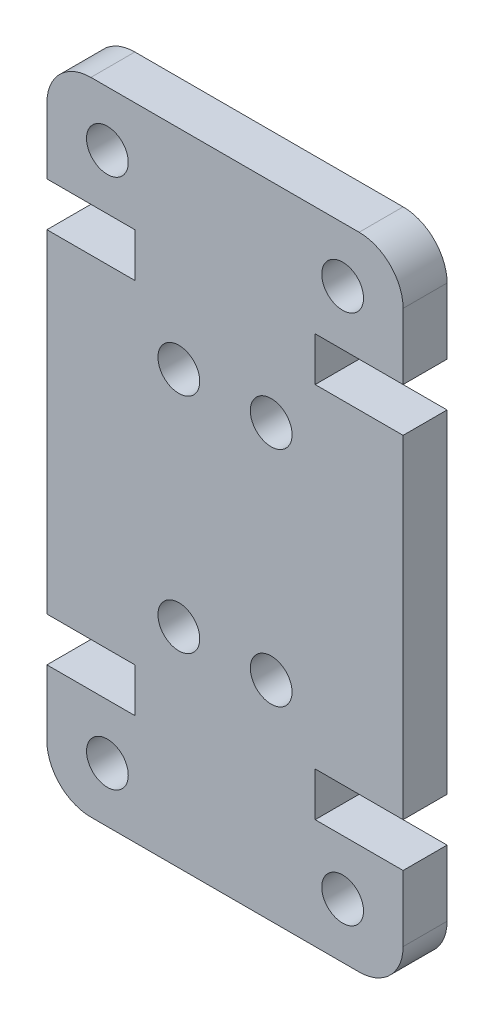
ISO-10303-21;
HEADER;
FILE_DESCRIPTION(('STEP AP214'),'2;1');
FILE_NAME('part.step','',(''),(''),'','','');
FILE_SCHEMA(('AUTOMOTIVE_DESIGN { 1 0 10303 214 1 1 1 1 }'));
ENDSEC;
DATA;
#1=APPLICATION_CONTEXT('core data for automotive mechanical design processes');
#2=APPLICATION_PROTOCOL_DEFINITION('international standard','automotive_design',2000,#1);
#3=PRODUCT_CONTEXT('',#1,'mechanical');
#4=PRODUCT('Part','Part','',(#3));
#5=PRODUCT_RELATED_PRODUCT_CATEGORY('part','',(#4));
#6=PRODUCT_DEFINITION_FORMATION('','',#4);
#7=PRODUCT_DEFINITION_CONTEXT('part definition',#1,'design');
#8=PRODUCT_DEFINITION('design','',#6,#7);
#9=PRODUCT_DEFINITION_SHAPE('','',#8);
#10=(LENGTH_UNIT() NAMED_UNIT(*) SI_UNIT(.MILLI.,.METRE.));
#11=(NAMED_UNIT(*) PLANE_ANGLE_UNIT() SI_UNIT($,.RADIAN.));
#12=(NAMED_UNIT(*) SI_UNIT($,.STERADIAN.) SOLID_ANGLE_UNIT());
#13=UNCERTAINTY_MEASURE_WITH_UNIT(LENGTH_MEASURE(1.E-05),#10,'distance_accuracy_value','');
#14=(GEOMETRIC_REPRESENTATION_CONTEXT(3) GLOBAL_UNCERTAINTY_ASSIGNED_CONTEXT((#13)) GLOBAL_UNIT_ASSIGNED_CONTEXT((#10,
#11,#12)) REPRESENTATION_CONTEXT('',''));
#15=CARTESIAN_POINT('',(0.,0.,0.));
#16=DIRECTION('',(0.,0.,1.));
#17=DIRECTION('',(1.,0.,0.));
#18=AXIS2_PLACEMENT_3D('',#15,#16,#17);
#19=CARTESIAN_POINT('',(2.00000000000002,2.,2.));
#20=DIRECTION('',(0.,0.,1.));
#21=DIRECTION('',(1.,0.,0.));
#22=AXIS2_PLACEMENT_3D('',#19,#20,#21);
#23=PLANE('',#22);
#24=CARTESIAN_POINT('',(10.2,19.6400000000004,2.));
#25=DIRECTION('',(0.,0.,1.));
#26=DIRECTION('',(1.,0.,0.));
#27=AXIS2_PLACEMENT_3D('',#24,#25,#26);
#28=CIRCLE('',#27,0.949999999999999);
#29=CARTESIAN_POINT('',(11.15,19.6400000000004,2.));
#30=VERTEX_POINT('',#29);
#31=EDGE_CURVE('E464',#30,#30,#28,.T.);
#32=ORIENTED_EDGE('',*,*,#31,.F.);
#33=EDGE_LOOP('',(#32));
#34=FACE_BOUND('',#33,.T.);
#35=CARTESIAN_POINT('',(6.,19.6400000000004,2.));
#36=DIRECTION('',(0.,0.,1.));
#37=DIRECTION('',(-1.,0.,0.));
#38=AXIS2_PLACEMENT_3D('',#35,#36,#37);
#39=CIRCLE('',#38,0.949999999999999);
#40=CARTESIAN_POINT('',(5.05,19.6400000000004,2.));
#41=VERTEX_POINT('',#40);
#42=EDGE_CURVE('E476',#41,#41,#39,.T.);
#43=ORIENTED_EDGE('',*,*,#42,.F.);
#44=EDGE_LOOP('',(#43));
#45=FACE_BOUND('',#44,.T.);
#46=CARTESIAN_POINT('',(2.75000000000004,26.6399999999998,2.));
#47=DIRECTION('',(0.,0.,1.));
#48=DIRECTION('',(-1.,0.,0.));
#49=AXIS2_PLACEMENT_3D('',#46,#47,#48);
#50=CIRCLE('',#49,0.95);
#51=CARTESIAN_POINT('',(1.80000000000004,26.6399999999998,2.));
#52=VERTEX_POINT('',#51);
#53=EDGE_CURVE('E488',#52,#52,#50,.T.);
#54=ORIENTED_EDGE('',*,*,#53,.F.);
#55=EDGE_LOOP('',(#54));
#56=FACE_BOUND('',#55,.T.);
#57=CARTESIAN_POINT('',(13.45,2.50000000000017,2.));
#58=DIRECTION('',(0.,0.,1.));
#59=DIRECTION('',(-1.,0.,0.));
#60=AXIS2_PLACEMENT_3D('',#57,#58,#59);
#61=CIRCLE('',#60,0.949999999999999);
#62=CARTESIAN_POINT('',(12.5,2.50000000000017,2.));
#63=VERTEX_POINT('',#62);
#64=EDGE_CURVE('E230',#63,#63,#61,.T.);
#65=ORIENTED_EDGE('',*,*,#64,.F.);
#66=EDGE_LOOP('',(#65));
#67=FACE_BOUND('',#66,.T.);
#68=DIRECTION('',(1.,0.,0.));
#69=VECTOR('',#68,1.);
#70=CARTESIAN_POINT('',(0.,6.99999999999946,2.));
#71=LINE('',#70,#69);
#72=CARTESIAN_POINT('',(0.,6.99999999999946,2.));
#73=VERTEX_POINT('',#72);
#74=CARTESIAN_POINT('',(4.00000000000002,6.99999999999946,2.));
#75=VERTEX_POINT('',#74);
#76=EDGE_CURVE('E273',#73,#75,#71,.T.);
#77=ORIENTED_EDGE('',*,*,#76,.T.);
#78=DIRECTION('',(0.,-1.,0.));
#79=VECTOR('',#78,1.);
#80=CARTESIAN_POINT('',(4.00000000000002,6.99999999999946,2.));
#81=LINE('',#80,#79);
#82=CARTESIAN_POINT('',(4.,4.99999999999945,2.));
#83=VERTEX_POINT('',#82);
#84=EDGE_CURVE('E141',#75,#83,#81,.T.);
#85=ORIENTED_EDGE('',*,*,#84,.T.);
#86=DIRECTION('',(-1.,0.,0.));
#87=VECTOR('',#86,1.);
#88=CARTESIAN_POINT('',(4.,4.99999999999945,2.));
#89=LINE('',#88,#87);
#90=CARTESIAN_POINT('',(0.,4.99999999999945,2.));
#91=VERTEX_POINT('',#90);
#92=EDGE_CURVE('E336',#83,#91,#89,.T.);
#93=ORIENTED_EDGE('',*,*,#92,.T.);
#94=DIRECTION('',(0.,-1.,0.));
#95=VECTOR('',#94,1.);
#96=CARTESIAN_POINT('',(0.,2.,2.));
#97=LINE('',#96,#95);
#98=CARTESIAN_POINT('',(0.,2.,2.));
#99=VERTEX_POINT('',#98);
#100=EDGE_CURVE('E355',#91,#99,#97,.T.);
#101=ORIENTED_EDGE('',*,*,#100,.T.);
#102=CARTESIAN_POINT('',(2.00000000000002,2.,2.));
#103=DIRECTION('',(0.,0.,1.));
#104=DIRECTION('',(1.,0.,0.));
#105=AXIS2_PLACEMENT_3D('',#102,#103,#104);
#106=CIRCLE('',#105,2.00000000000001);
#107=CARTESIAN_POINT('',(2.00000000000002,0.,2.));
#108=VERTEX_POINT('',#107);
#109=EDGE_CURVE('E352',#99,#108,#106,.T.);
#110=ORIENTED_EDGE('',*,*,#109,.T.);
#111=DIRECTION('',(1.,0.,0.));
#112=VECTOR('',#111,1.);
#113=CARTESIAN_POINT('',(2.00000000000002,0.,2.));
#114=LINE('',#113,#112);
#115=CARTESIAN_POINT('',(14.2,0.,2.));
#116=VERTEX_POINT('',#115);
#117=EDGE_CURVE('E354',#108,#116,#114,.T.);
#118=ORIENTED_EDGE('',*,*,#117,.T.);
#119=CARTESIAN_POINT('',(14.2,2.,2.));
#120=DIRECTION('',(0.,0.,1.));
#121=DIRECTION('',(-1.,0.,0.));
#122=AXIS2_PLACEMENT_3D('',#119,#120,#121);
#123=CIRCLE('',#122,2.);
#124=CARTESIAN_POINT('',(16.2,2.,2.));
#125=VERTEX_POINT('',#124);
#126=EDGE_CURVE('E357',#116,#125,#123,.T.);
#127=ORIENTED_EDGE('',*,*,#126,.T.);
#128=DIRECTION('',(0.,1.,0.));
#129=VECTOR('',#128,1.);
#130=CARTESIAN_POINT('',(16.2,2.,2.));
#131=LINE('',#130,#129);
#132=CARTESIAN_POINT('',(16.2,4.99999999999945,2.));
#133=VERTEX_POINT('',#132);
#134=EDGE_CURVE('E363',#125,#133,#131,.T.);
#135=ORIENTED_EDGE('',*,*,#134,.T.);
#136=DIRECTION('',(-1.,0.,0.));
#137=VECTOR('',#136,1.);
#138=CARTESIAN_POINT('',(12.2,4.99999999999945,2.));
#139=LINE('',#138,#137);
#140=CARTESIAN_POINT('',(12.2,4.99999999999945,2.));
#141=VERTEX_POINT('',#140);
#142=EDGE_CURVE('E365',#133,#141,#139,.T.);
#143=ORIENTED_EDGE('',*,*,#142,.T.);
#144=DIRECTION('',(0.,1.,0.));
#145=VECTOR('',#144,1.);
#146=CARTESIAN_POINT('',(12.2,6.99999999999945,2.));
#147=LINE('',#146,#145);
#148=CARTESIAN_POINT('',(12.2,6.99999999999945,2.));
#149=VERTEX_POINT('',#148);
#150=EDGE_CURVE('E367',#141,#149,#147,.T.);
#151=ORIENTED_EDGE('',*,*,#150,.T.);
#152=DIRECTION('',(1.,0.,0.));
#153=VECTOR('',#152,1.);
#154=CARTESIAN_POINT('',(16.2,6.99999999999945,2.));
#155=LINE('',#154,#153);
#156=CARTESIAN_POINT('',(16.2,6.99999999999945,2.));
#157=VERTEX_POINT('',#156);
#158=EDGE_CURVE('E369',#149,#157,#155,.T.);
#159=ORIENTED_EDGE('',*,*,#158,.T.);
#160=DIRECTION('',(0.,1.,0.));
#161=VECTOR('',#160,1.);
#162=CARTESIAN_POINT('',(16.2,22.1400000000005,2.));
#163=LINE('',#162,#161);
#164=CARTESIAN_POINT('',(16.2,22.1400000000005,2.));
#165=VERTEX_POINT('',#164);
#166=EDGE_CURVE('E371',#157,#165,#163,.T.);
#167=ORIENTED_EDGE('',*,*,#166,.T.);
#168=DIRECTION('',(-1.,0.,0.));
#169=VECTOR('',#168,1.);
#170=CARTESIAN_POINT('',(16.2,22.1400000000005,2.));
#171=LINE('',#170,#169);
#172=CARTESIAN_POINT('',(12.2,22.1400000000005,2.));
#173=VERTEX_POINT('',#172);
#174=EDGE_CURVE('E373',#165,#173,#171,.T.);
#175=ORIENTED_EDGE('',*,*,#174,.T.);
#176=DIRECTION('',(0.,1.,0.));
#177=VECTOR('',#176,1.);
#178=CARTESIAN_POINT('',(12.2,22.1400000000005,2.));
#179=LINE('',#178,#177);
#180=CARTESIAN_POINT('',(12.2,24.1400000000006,2.));
#181=VERTEX_POINT('',#180);
#182=EDGE_CURVE('E375',#173,#181,#179,.T.);
#183=ORIENTED_EDGE('',*,*,#182,.T.);
#184=DIRECTION('',(1.,0.,0.));
#185=VECTOR('',#184,1.);
#186=CARTESIAN_POINT('',(12.2,24.1400000000006,2.));
#187=LINE('',#186,#185);
#188=CARTESIAN_POINT('',(16.2,24.1400000000006,2.));
#189=VERTEX_POINT('',#188);
#190=EDGE_CURVE('E377',#181,#189,#187,.T.);
#191=ORIENTED_EDGE('',*,*,#190,.T.);
#192=DIRECTION('',(0.,1.,0.));
#193=VECTOR('',#192,1.);
#194=CARTESIAN_POINT('',(16.2,27.14,2.));
#195=LINE('',#194,#193);
#196=CARTESIAN_POINT('',(16.2,27.14,2.));
#197=VERTEX_POINT('',#196);
#198=EDGE_CURVE('E379',#189,#197,#195,.T.);
#199=ORIENTED_EDGE('',*,*,#198,.T.);
#200=CARTESIAN_POINT('',(14.2,27.14,2.));
#201=DIRECTION('',(0.,0.,1.));
#202=DIRECTION('',(1.,0.,0.));
#203=AXIS2_PLACEMENT_3D('',#200,#201,#202);
#204=CIRCLE('',#203,2.);
#205=CARTESIAN_POINT('',(14.2,29.14,2.));
#206=VERTEX_POINT('',#205);
#207=EDGE_CURVE('E381',#197,#206,#204,.T.);
#208=ORIENTED_EDGE('',*,*,#207,.T.);
#209=DIRECTION('',(-1.,0.,0.));
#210=VECTOR('',#209,1.);
#211=CARTESIAN_POINT('',(1.99999999999999,29.14,2.));
#212=LINE('',#211,#210);
#213=CARTESIAN_POINT('',(1.99999999999999,29.14,2.));
#214=VERTEX_POINT('',#213);
#215=EDGE_CURVE('E383',#206,#214,#212,.T.);
#216=ORIENTED_EDGE('',*,*,#215,.T.);
#217=CARTESIAN_POINT('',(2.,27.14,2.));
#218=DIRECTION('',(0.,0.,1.));
#219=DIRECTION('',(-1.,0.,0.));
#220=AXIS2_PLACEMENT_3D('',#217,#218,#219);
#221=CIRCLE('',#220,2.);
#222=CARTESIAN_POINT('',(0.,27.14,2.));
#223=VERTEX_POINT('',#222);
#224=EDGE_CURVE('E385',#214,#223,#221,.T.);
#225=ORIENTED_EDGE('',*,*,#224,.T.);
#226=DIRECTION('',(0.,-1.,0.));
#227=VECTOR('',#226,1.);
#228=CARTESIAN_POINT('',(0.,27.14,2.));
#229=LINE('',#228,#227);
#230=CARTESIAN_POINT('',(0.,24.1400000000005,2.));
#231=VERTEX_POINT('',#230);
#232=EDGE_CURVE('E387',#223,#231,#229,.T.);
#233=ORIENTED_EDGE('',*,*,#232,.T.);
#234=DIRECTION('',(1.,0.,0.));
#235=VECTOR('',#234,1.);
#236=CARTESIAN_POINT('',(3.99999999999999,24.1400000000006,2.));
#237=LINE('',#236,#235);
#238=CARTESIAN_POINT('',(3.99999999999999,24.1400000000006,2.));
#239=VERTEX_POINT('',#238);
#240=EDGE_CURVE('E208',#231,#239,#237,.T.);
#241=ORIENTED_EDGE('',*,*,#240,.T.);
#242=DIRECTION('',(0.,-1.,0.));
#243=VECTOR('',#242,1.);
#244=CARTESIAN_POINT('',(4.,22.1400000000005,2.));
#245=LINE('',#244,#243);
#246=CARTESIAN_POINT('',(4.,22.1400000000005,2.));
#247=VERTEX_POINT('',#246);
#248=EDGE_CURVE('E202',#239,#247,#245,.T.);
#249=ORIENTED_EDGE('',*,*,#248,.T.);
#250=DIRECTION('',(-1.,0.,0.));
#251=VECTOR('',#250,1.);
#252=CARTESIAN_POINT('',(0.,22.1400000000005,2.));
#253=LINE('',#252,#251);
#254=CARTESIAN_POINT('',(0.,22.1400000000005,2.));
#255=VERTEX_POINT('',#254);
#256=EDGE_CURVE('E206',#247,#255,#253,.T.);
#257=ORIENTED_EDGE('',*,*,#256,.T.);
#258=DIRECTION('',(0.,-1.,0.));
#259=VECTOR('',#258,1.);
#260=CARTESIAN_POINT('',(0.,22.1400000000005,2.));
#261=LINE('',#260,#259);
#262=EDGE_CURVE('E50',#255,#73,#261,.T.);
#263=ORIENTED_EDGE('',*,*,#262,.T.);
#264=EDGE_LOOP('',(#77,#85,#93,#101,#110,#118,#127,#135,#143,#151,#159,#167,#175,#183,#191,#199,
#208,#216,#225,#233,#241,#249,#257,#263));
#265=FACE_BOUND('',#264,.T.);
#266=CARTESIAN_POINT('',(10.2,9.49999999999962,2.));
#267=DIRECTION('',(0.,0.,1.));
#268=DIRECTION('',(-1.,0.,0.));
#269=AXIS2_PLACEMENT_3D('',#266,#267,#268);
#270=CIRCLE('',#269,0.949999999999999);
#271=CARTESIAN_POINT('',(9.24999999999999,9.49999999999962,2.));
#272=VERTEX_POINT('',#271);
#273=EDGE_CURVE('E494',#272,#272,#270,.T.);
#274=ORIENTED_EDGE('',*,*,#273,.F.);
#275=EDGE_LOOP('',(#274));
#276=FACE_BOUND('',#275,.T.);
#277=CARTESIAN_POINT('',(6.00000000000001,9.49999999999962,2.));
#278=DIRECTION('',(0.,0.,1.));
#279=DIRECTION('',(1.,0.,0.));
#280=AXIS2_PLACEMENT_3D('',#277,#278,#279);
#281=CIRCLE('',#280,0.95);
#282=CARTESIAN_POINT('',(6.95,9.49999999999962,2.));
#283=VERTEX_POINT('',#282);
#284=EDGE_CURVE('E482',#283,#283,#281,.T.);
#285=ORIENTED_EDGE('',*,*,#284,.F.);
#286=EDGE_LOOP('',(#285));
#287=FACE_BOUND('',#286,.T.);
#288=CARTESIAN_POINT('',(2.75000000000004,2.50000000000017,2.));
#289=DIRECTION('',(0.,0.,1.));
#290=DIRECTION('',(1.,0.,0.));
#291=AXIS2_PLACEMENT_3D('',#288,#289,#290);
#292=CIRCLE('',#291,0.95);
#293=CARTESIAN_POINT('',(3.70000000000004,2.50000000000017,2.));
#294=VERTEX_POINT('',#293);
#295=EDGE_CURVE('E470',#294,#294,#292,.T.);
#296=ORIENTED_EDGE('',*,*,#295,.F.);
#297=EDGE_LOOP('',(#296));
#298=FACE_BOUND('',#297,.T.);
#299=CARTESIAN_POINT('',(13.45,26.6399999999998,2.));
#300=DIRECTION('',(0.,0.,1.));
#301=DIRECTION('',(1.,0.,0.));
#302=AXIS2_PLACEMENT_3D('',#299,#300,#301);
#303=CIRCLE('',#302,0.949999999999999);
#304=CARTESIAN_POINT('',(14.4,26.6399999999998,2.));
#305=VERTEX_POINT('',#304);
#306=EDGE_CURVE('E455',#305,#305,#303,.T.);
#307=ORIENTED_EDGE('',*,*,#306,.F.);
#308=EDGE_LOOP('',(#307));
#309=FACE_BOUND('',#308,.T.);
#310=ADVANCED_FACE('F33',(#34,#45,#56,#67,#265,#276,#287,#298,#309),#23,.T.);
#311=CARTESIAN_POINT('',(2.00000000000002,2.,0.));
#312=DIRECTION('',(0.,0.,1.));
#313=DIRECTION('',(1.,0.,0.));
#314=AXIS2_PLACEMENT_3D('',#311,#312,#313);
#315=PLANE('',#314);
#316=CARTESIAN_POINT('',(10.2,19.6400000000004,0.));
#317=DIRECTION('',(0.,0.,1.));
#318=DIRECTION('',(1.,0.,0.));
#319=AXIS2_PLACEMENT_3D('',#316,#317,#318);
#320=CIRCLE('',#319,0.949999999999999);
#321=CARTESIAN_POINT('',(11.15,19.6400000000004,0.));
#322=VERTEX_POINT('',#321);
#323=EDGE_CURVE('E461',#322,#322,#320,.T.);
#324=ORIENTED_EDGE('',*,*,#323,.T.);
#325=EDGE_LOOP('',(#324));
#326=FACE_BOUND('',#325,.T.);
#327=CARTESIAN_POINT('',(6.,19.6400000000004,0.));
#328=DIRECTION('',(0.,0.,1.));
#329=DIRECTION('',(-1.,0.,0.));
#330=AXIS2_PLACEMENT_3D('',#327,#328,#329);
#331=CIRCLE('',#330,0.949999999999999);
#332=CARTESIAN_POINT('',(5.05,19.6400000000004,0.));
#333=VERTEX_POINT('',#332);
#334=EDGE_CURVE('E473',#333,#333,#331,.T.);
#335=ORIENTED_EDGE('',*,*,#334,.T.);
#336=EDGE_LOOP('',(#335));
#337=FACE_BOUND('',#336,.T.);
#338=CARTESIAN_POINT('',(2.75000000000004,26.6399999999998,0.));
#339=DIRECTION('',(0.,0.,1.));
#340=DIRECTION('',(-1.,0.,0.));
#341=AXIS2_PLACEMENT_3D('',#338,#339,#340);
#342=CIRCLE('',#341,0.95);
#343=CARTESIAN_POINT('',(1.80000000000004,26.6399999999998,0.));
#344=VERTEX_POINT('',#343);
#345=EDGE_CURVE('E485',#344,#344,#342,.T.);
#346=ORIENTED_EDGE('',*,*,#345,.T.);
#347=EDGE_LOOP('',(#346));
#348=FACE_BOUND('',#347,.T.);
#349=CARTESIAN_POINT('',(13.45,2.50000000000017,0.));
#350=DIRECTION('',(0.,0.,1.));
#351=DIRECTION('',(-1.,0.,0.));
#352=AXIS2_PLACEMENT_3D('',#349,#350,#351);
#353=CIRCLE('',#352,0.949999999999999);
#354=CARTESIAN_POINT('',(12.5,2.50000000000017,0.));
#355=VERTEX_POINT('',#354);
#356=EDGE_CURVE('E497',#355,#355,#353,.T.);
#357=ORIENTED_EDGE('',*,*,#356,.T.);
#358=EDGE_LOOP('',(#357));
#359=FACE_BOUND('',#358,.T.);
#360=DIRECTION('',(1.,0.,0.));
#361=VECTOR('',#360,1.);
#362=CARTESIAN_POINT('',(0.,6.99999999999946,0.));
#363=LINE('',#362,#361);
#364=CARTESIAN_POINT('',(0.,6.99999999999946,0.));
#365=VERTEX_POINT('',#364);
#366=CARTESIAN_POINT('',(4.00000000000002,6.99999999999946,0.));
#367=VERTEX_POINT('',#366);
#368=EDGE_CURVE('E226',#365,#367,#363,.T.);
#369=ORIENTED_EDGE('',*,*,#368,.F.);
#370=DIRECTION('',(0.,-1.,0.));
#371=VECTOR('',#370,1.);
#372=CARTESIAN_POINT('',(0.,22.1400000000005,0.));
#373=LINE('',#372,#371);
#374=CARTESIAN_POINT('',(0.,22.1400000000005,0.));
#375=VERTEX_POINT('',#374);
#376=EDGE_CURVE('E133',#375,#365,#373,.T.);
#377=ORIENTED_EDGE('',*,*,#376,.F.);
#378=DIRECTION('',(-1.,0.,0.));
#379=VECTOR('',#378,1.);
#380=CARTESIAN_POINT('',(0.,22.1400000000005,0.));
#381=LINE('',#380,#379);
#382=CARTESIAN_POINT('',(4.,22.1400000000005,0.));
#383=VERTEX_POINT('',#382);
#384=EDGE_CURVE('E127',#383,#375,#381,.T.);
#385=ORIENTED_EDGE('',*,*,#384,.F.);
#386=DIRECTION('',(0.,-1.,0.));
#387=VECTOR('',#386,1.);
#388=CARTESIAN_POINT('',(4.,22.1400000000005,0.));
#389=LINE('',#388,#387);
#390=CARTESIAN_POINT('',(3.99999999999999,24.1400000000006,0.));
#391=VERTEX_POINT('',#390);
#392=EDGE_CURVE('E216',#391,#383,#389,.T.);
#393=ORIENTED_EDGE('',*,*,#392,.F.);
#394=DIRECTION('',(1.,0.,0.));
#395=VECTOR('',#394,1.);
#396=CARTESIAN_POINT('',(3.99999999999999,24.1400000000006,0.));
#397=LINE('',#396,#395);
#398=CARTESIAN_POINT('',(0.,24.1400000000005,0.));
#399=VERTEX_POINT('',#398);
#400=EDGE_CURVE('E268',#399,#391,#397,.T.);
#401=ORIENTED_EDGE('',*,*,#400,.F.);
#402=DIRECTION('',(0.,-1.,0.));
#403=VECTOR('',#402,1.);
#404=CARTESIAN_POINT('',(0.,27.14,0.));
#405=LINE('',#404,#403);
#406=CARTESIAN_POINT('',(0.,27.14,0.));
#407=VERTEX_POINT('',#406);
#408=EDGE_CURVE('E266',#407,#399,#405,.T.);
#409=ORIENTED_EDGE('',*,*,#408,.F.);
#410=CARTESIAN_POINT('',(2.,27.14,0.));
#411=DIRECTION('',(0.,0.,1.));
#412=DIRECTION('',(-1.,0.,0.));
#413=AXIS2_PLACEMENT_3D('',#410,#411,#412);
#414=CIRCLE('',#413,2.);
#415=CARTESIAN_POINT('',(1.99999999999999,29.14,0.));
#416=VERTEX_POINT('',#415);
#417=EDGE_CURVE('E264',#416,#407,#414,.T.);
#418=ORIENTED_EDGE('',*,*,#417,.F.);
#419=DIRECTION('',(-1.,0.,0.));
#420=VECTOR('',#419,1.);
#421=CARTESIAN_POINT('',(1.99999999999999,29.14,0.));
#422=LINE('',#421,#420);
#423=CARTESIAN_POINT('',(14.2,29.14,0.));
#424=VERTEX_POINT('',#423);
#425=EDGE_CURVE('E262',#424,#416,#422,.T.);
#426=ORIENTED_EDGE('',*,*,#425,.F.);
#427=CARTESIAN_POINT('',(14.2,27.14,0.));
#428=DIRECTION('',(0.,0.,1.));
#429=DIRECTION('',(1.,0.,0.));
#430=AXIS2_PLACEMENT_3D('',#427,#428,#429);
#431=CIRCLE('',#430,2.);
#432=CARTESIAN_POINT('',(16.2,27.14,0.));
#433=VERTEX_POINT('',#432);
#434=EDGE_CURVE('E260',#433,#424,#431,.T.);
#435=ORIENTED_EDGE('',*,*,#434,.F.);
#436=DIRECTION('',(0.,1.,0.));
#437=VECTOR('',#436,1.);
#438=CARTESIAN_POINT('',(16.2,27.14,0.));
#439=LINE('',#438,#437);
#440=CARTESIAN_POINT('',(16.2,24.1400000000006,0.));
#441=VERTEX_POINT('',#440);
#442=EDGE_CURVE('E258',#441,#433,#439,.T.);
#443=ORIENTED_EDGE('',*,*,#442,.F.);
#444=DIRECTION('',(1.,0.,0.));
#445=VECTOR('',#444,1.);
#446=CARTESIAN_POINT('',(12.2,24.1400000000006,0.));
#447=LINE('',#446,#445);
#448=CARTESIAN_POINT('',(12.2,24.1400000000006,0.));
#449=VERTEX_POINT('',#448);
#450=EDGE_CURVE('E256',#449,#441,#447,.T.);
#451=ORIENTED_EDGE('',*,*,#450,.F.);
#452=DIRECTION('',(0.,1.,0.));
#453=VECTOR('',#452,1.);
#454=CARTESIAN_POINT('',(12.2,22.1400000000005,0.));
#455=LINE('',#454,#453);
#456=CARTESIAN_POINT('',(12.2,22.1400000000005,0.));
#457=VERTEX_POINT('',#456);
#458=EDGE_CURVE('E254',#457,#449,#455,.T.);
#459=ORIENTED_EDGE('',*,*,#458,.F.);
#460=DIRECTION('',(-1.,0.,0.));
#461=VECTOR('',#460,1.);
#462=CARTESIAN_POINT('',(16.2,22.1400000000005,0.));
#463=LINE('',#462,#461);
#464=CARTESIAN_POINT('',(16.2,22.1400000000005,0.));
#465=VERTEX_POINT('',#464);
#466=EDGE_CURVE('E252',#465,#457,#463,.T.);
#467=ORIENTED_EDGE('',*,*,#466,.F.);
#468=DIRECTION('',(0.,1.,0.));
#469=VECTOR('',#468,1.);
#470=CARTESIAN_POINT('',(16.2,22.1400000000005,0.));
#471=LINE('',#470,#469);
#472=CARTESIAN_POINT('',(16.2,6.99999999999945,0.));
#473=VERTEX_POINT('',#472);
#474=EDGE_CURVE('E250',#473,#465,#471,.T.);
#475=ORIENTED_EDGE('',*,*,#474,.F.);
#476=DIRECTION('',(1.,0.,0.));
#477=VECTOR('',#476,1.);
#478=CARTESIAN_POINT('',(16.2,6.99999999999945,0.));
#479=LINE('',#478,#477);
#480=CARTESIAN_POINT('',(12.2,6.99999999999945,0.));
#481=VERTEX_POINT('',#480);
#482=EDGE_CURVE('E248',#481,#473,#479,.T.);
#483=ORIENTED_EDGE('',*,*,#482,.F.);
#484=DIRECTION('',(0.,1.,0.));
#485=VECTOR('',#484,1.);
#486=CARTESIAN_POINT('',(12.2,6.99999999999945,0.));
#487=LINE('',#486,#485);
#488=CARTESIAN_POINT('',(12.2,4.99999999999945,0.));
#489=VERTEX_POINT('',#488);
#490=EDGE_CURVE('E246',#489,#481,#487,.T.);
#491=ORIENTED_EDGE('',*,*,#490,.F.);
#492=DIRECTION('',(-1.,0.,0.));
#493=VECTOR('',#492,1.);
#494=CARTESIAN_POINT('',(12.2,4.99999999999945,0.));
#495=LINE('',#494,#493);
#496=CARTESIAN_POINT('',(16.2,4.99999999999945,0.));
#497=VERTEX_POINT('',#496);
#498=EDGE_CURVE('E244',#497,#489,#495,.T.);
#499=ORIENTED_EDGE('',*,*,#498,.F.);
#500=DIRECTION('',(0.,1.,0.));
#501=VECTOR('',#500,1.);
#502=CARTESIAN_POINT('',(16.2,2.,0.));
#503=LINE('',#502,#501);
#504=CARTESIAN_POINT('',(16.2,2.,0.));
#505=VERTEX_POINT('',#504);
#506=EDGE_CURVE('E242',#505,#497,#503,.T.);
#507=ORIENTED_EDGE('',*,*,#506,.F.);
#508=CARTESIAN_POINT('',(14.2,2.,0.));
#509=DIRECTION('',(0.,0.,1.));
#510=DIRECTION('',(-1.,0.,0.));
#511=AXIS2_PLACEMENT_3D('',#508,#509,#510);
#512=CIRCLE('',#511,2.);
#513=CARTESIAN_POINT('',(14.2,0.,0.));
#514=VERTEX_POINT('',#513);
#515=EDGE_CURVE('E240',#514,#505,#512,.T.);
#516=ORIENTED_EDGE('',*,*,#515,.F.);
#517=DIRECTION('',(1.,0.,0.));
#518=VECTOR('',#517,1.);
#519=CARTESIAN_POINT('',(2.00000000000002,0.,0.));
#520=LINE('',#519,#518);
#521=CARTESIAN_POINT('',(2.00000000000002,0.,0.));
#522=VERTEX_POINT('',#521);
#523=EDGE_CURVE('E238',#522,#514,#520,.T.);
#524=ORIENTED_EDGE('',*,*,#523,.F.);
#525=CARTESIAN_POINT('',(2.00000000000002,2.,0.));
#526=DIRECTION('',(0.,0.,1.));
#527=DIRECTION('',(1.,0.,0.));
#528=AXIS2_PLACEMENT_3D('',#525,#526,#527);
#529=CIRCLE('',#528,2.00000000000001);
#530=CARTESIAN_POINT('',(0.,2.,0.));
#531=VERTEX_POINT('',#530);
#532=EDGE_CURVE('E236',#531,#522,#529,.T.);
#533=ORIENTED_EDGE('',*,*,#532,.F.);
#534=DIRECTION('',(0.,-1.,0.));
#535=VECTOR('',#534,1.);
#536=CARTESIAN_POINT('',(0.,2.,0.));
#537=LINE('',#536,#535);
#538=CARTESIAN_POINT('',(0.,4.99999999999945,0.));
#539=VERTEX_POINT('',#538);
#540=EDGE_CURVE('E234',#539,#531,#537,.T.);
#541=ORIENTED_EDGE('',*,*,#540,.F.);
#542=DIRECTION('',(-1.,0.,0.));
#543=VECTOR('',#542,1.);
#544=CARTESIAN_POINT('',(4.,4.99999999999945,0.));
#545=LINE('',#544,#543);
#546=CARTESIAN_POINT('',(4.,4.99999999999945,0.));
#547=VERTEX_POINT('',#546);
#548=EDGE_CURVE('E232',#547,#539,#545,.T.);
#549=ORIENTED_EDGE('',*,*,#548,.F.);
#550=DIRECTION('',(0.,-1.,0.));
#551=VECTOR('',#550,1.);
#552=CARTESIAN_POINT('',(4.00000000000002,6.99999999999946,0.));
#553=LINE('',#552,#551);
#554=EDGE_CURVE('E229',#367,#547,#553,.T.);
#555=ORIENTED_EDGE('',*,*,#554,.F.);
#556=EDGE_LOOP('',(#369,#377,#385,#393,#401,#409,#418,#426,#435,#443,#451,#459,#467,#475,#483,
#491,#499,#507,#516,#524,#533,#541,#549,#555));
#557=FACE_BOUND('',#556,.T.);
#558=CARTESIAN_POINT('',(10.2,9.49999999999962,0.));
#559=DIRECTION('',(0.,0.,1.));
#560=DIRECTION('',(-1.,0.,0.));
#561=AXIS2_PLACEMENT_3D('',#558,#559,#560);
#562=CIRCLE('',#561,0.949999999999999);
#563=CARTESIAN_POINT('',(9.24999999999999,9.49999999999962,0.));
#564=VERTEX_POINT('',#563);
#565=EDGE_CURVE('E491',#564,#564,#562,.T.);
#566=ORIENTED_EDGE('',*,*,#565,.T.);
#567=EDGE_LOOP('',(#566));
#568=FACE_BOUND('',#567,.T.);
#569=CARTESIAN_POINT('',(6.00000000000001,9.49999999999962,0.));
#570=DIRECTION('',(0.,0.,1.));
#571=DIRECTION('',(1.,0.,0.));
#572=AXIS2_PLACEMENT_3D('',#569,#570,#571);
#573=CIRCLE('',#572,0.95);
#574=CARTESIAN_POINT('',(6.95,9.49999999999962,0.));
#575=VERTEX_POINT('',#574);
#576=EDGE_CURVE('E479',#575,#575,#573,.T.);
#577=ORIENTED_EDGE('',*,*,#576,.T.);
#578=EDGE_LOOP('',(#577));
#579=FACE_BOUND('',#578,.T.);
#580=CARTESIAN_POINT('',(2.75000000000004,2.50000000000017,0.));
#581=DIRECTION('',(0.,0.,1.));
#582=DIRECTION('',(1.,0.,0.));
#583=AXIS2_PLACEMENT_3D('',#580,#581,#582);
#584=CIRCLE('',#583,0.95);
#585=CARTESIAN_POINT('',(3.70000000000004,2.50000000000017,0.));
#586=VERTEX_POINT('',#585);
#587=EDGE_CURVE('E467',#586,#586,#584,.T.);
#588=ORIENTED_EDGE('',*,*,#587,.T.);
#589=EDGE_LOOP('',(#588));
#590=FACE_BOUND('',#589,.T.);
#591=CARTESIAN_POINT('',(13.45,26.6399999999998,0.));
#592=DIRECTION('',(0.,0.,1.));
#593=DIRECTION('',(1.,0.,0.));
#594=AXIS2_PLACEMENT_3D('',#591,#592,#593);
#595=CIRCLE('',#594,0.949999999999999);
#596=CARTESIAN_POINT('',(14.4,26.6399999999998,0.));
#597=VERTEX_POINT('',#596);
#598=EDGE_CURVE('E458',#597,#597,#595,.T.);
#599=ORIENTED_EDGE('',*,*,#598,.T.);
#600=EDGE_LOOP('',(#599));
#601=FACE_BOUND('',#600,.T.);
#602=ADVANCED_FACE('F340',(#326,#337,#348,#359,#557,#568,#579,#590,#601),#315,.F.);
#603=CARTESIAN_POINT('',(0.,6.99999999999946,2.));
#604=DIRECTION('',(0.,1.,0.));
#605=DIRECTION('',(0.,0.,1.));
#606=AXIS2_PLACEMENT_3D('',#603,#604,#605);
#607=PLANE('',#606);
#608=ORIENTED_EDGE('',*,*,#368,.T.);
#609=DIRECTION('',(0.,0.,-1.));
#610=VECTOR('',#609,1.);
#611=CARTESIAN_POINT('',(4.00000000000002,6.99999999999946,2.));
#612=LINE('',#611,#610);
#613=EDGE_CURVE('E11',#75,#367,#612,.T.);
#614=ORIENTED_EDGE('',*,*,#613,.F.);
#615=ORIENTED_EDGE('',*,*,#76,.F.);
#616=DIRECTION('',(0.,0.,-1.));
#617=VECTOR('',#616,1.);
#618=CARTESIAN_POINT('',(0.,6.99999999999946,2.));
#619=LINE('',#618,#617);
#620=EDGE_CURVE('E222',#73,#365,#619,.T.);
#621=ORIENTED_EDGE('',*,*,#620,.T.);
#622=EDGE_LOOP('',(#608,#614,#615,#621));
#623=FACE_BOUND('',#622,.T.);
#624=ADVANCED_FACE('F35',(#623),#607,.F.);
#625=CARTESIAN_POINT('',(4.00000000000002,6.99999999999946,2.));
#626=DIRECTION('',(1.,0.,0.));
#627=DIRECTION('',(0.,1.,0.));
#628=AXIS2_PLACEMENT_3D('',#625,#626,#627);
#629=PLANE('',#628);
#630=ORIENTED_EDGE('',*,*,#554,.T.);
#631=DIRECTION('',(0.,0.,-1.));
#632=VECTOR('',#631,1.);
#633=CARTESIAN_POINT('',(4.,4.99999999999945,2.));
#634=LINE('',#633,#632);
#635=EDGE_CURVE('E42',#83,#547,#634,.T.);
#636=ORIENTED_EDGE('',*,*,#635,.F.);
#637=ORIENTED_EDGE('',*,*,#84,.F.);
#638=ORIENTED_EDGE('',*,*,#613,.T.);
#639=EDGE_LOOP('',(#630,#636,#637,#638));
#640=FACE_BOUND('',#639,.T.);
#641=ADVANCED_FACE('F762',(#640),#629,.F.);
#642=CARTESIAN_POINT('',(4.,4.99999999999945,2.));
#643=DIRECTION('',(0.,-1.,0.));
#644=DIRECTION('',(0.,0.,-1.));
#645=AXIS2_PLACEMENT_3D('',#642,#643,#644);
#646=PLANE('',#645);
#647=ORIENTED_EDGE('',*,*,#548,.T.);
#648=DIRECTION('',(0.,0.,-1.));
#649=VECTOR('',#648,1.);
#650=CARTESIAN_POINT('',(0.,4.99999999999945,2.));
#651=LINE('',#650,#649);
#652=EDGE_CURVE('E328',#91,#539,#651,.T.);
#653=ORIENTED_EDGE('',*,*,#652,.F.);
#654=ORIENTED_EDGE('',*,*,#92,.F.);
#655=ORIENTED_EDGE('',*,*,#635,.T.);
#656=EDGE_LOOP('',(#647,#653,#654,#655));
#657=FACE_BOUND('',#656,.T.);
#658=ADVANCED_FACE('F334',(#657),#646,.F.);
#659=CARTESIAN_POINT('',(0.,2.,2.));
#660=DIRECTION('',(1.,0.,0.));
#661=DIRECTION('',(0.,0.,-1.));
#662=AXIS2_PLACEMENT_3D('',#659,#660,#661);
#663=PLANE('',#662);
#664=ORIENTED_EDGE('',*,*,#540,.T.);
#665=DIRECTION('',(0.,0.,-1.));
#666=VECTOR('',#665,1.);
#667=CARTESIAN_POINT('',(0.,2.,2.));
#668=LINE('',#667,#666);
#669=EDGE_CURVE('E325',#99,#531,#668,.T.);
#670=ORIENTED_EDGE('',*,*,#669,.F.);
#671=ORIENTED_EDGE('',*,*,#100,.F.);
#672=ORIENTED_EDGE('',*,*,#652,.T.);
#673=EDGE_LOOP('',(#664,#670,#671,#672));
#674=FACE_BOUND('',#673,.T.);
#675=ADVANCED_FACE('F346',(#674),#663,.F.);
#676=CARTESIAN_POINT('',(2.00000000000002,2.,2.));
#677=DIRECTION('',(0.,0.,-1.));
#678=DIRECTION('',(-1.,0.,0.));
#679=AXIS2_PLACEMENT_3D('',#676,#677,#678);
#680=CYLINDRICAL_SURFACE('',#679,2.00000000000001);
#681=ORIENTED_EDGE('',*,*,#532,.T.);
#682=DIRECTION('',(0.,0.,-1.));
#683=VECTOR('',#682,1.);
#684=CARTESIAN_POINT('',(2.00000000000002,0.,2.));
#685=LINE('',#684,#683);
#686=EDGE_CURVE('E322',#108,#522,#685,.T.);
#687=ORIENTED_EDGE('',*,*,#686,.F.);
#688=ORIENTED_EDGE('',*,*,#109,.F.);
#689=ORIENTED_EDGE('',*,*,#669,.T.);
#690=EDGE_LOOP('',(#681,#687,#688,#689));
#691=FACE_BOUND('',#690,.T.);
#692=ADVANCED_FACE('F350',(#691),#680,.T.);
#693=CARTESIAN_POINT('',(2.00000000000002,0.,2.));
#694=DIRECTION('',(0.,1.,0.));
#695=DIRECTION('',(-1.,0.,0.));
#696=AXIS2_PLACEMENT_3D('',#693,#694,#695);
#697=PLANE('',#696);
#698=ORIENTED_EDGE('',*,*,#523,.T.);
#699=DIRECTION('',(0.,0.,-1.));
#700=VECTOR('',#699,1.);
#701=CARTESIAN_POINT('',(14.2,0.,2.));
#702=LINE('',#701,#700);
#703=EDGE_CURVE('E319',#116,#514,#702,.T.);
#704=ORIENTED_EDGE('',*,*,#703,.F.);
#705=ORIENTED_EDGE('',*,*,#117,.F.);
#706=ORIENTED_EDGE('',*,*,#686,.T.);
#707=EDGE_LOOP('',(#698,#704,#705,#706));
#708=FACE_BOUND('',#707,.T.);
#709=ADVANCED_FACE('F727',(#708),#697,.F.);
#710=CARTESIAN_POINT('',(14.2,2.,2.));
#711=DIRECTION('',(0.,0.,-1.));
#712=DIRECTION('',(-1.,0.,0.));
#713=AXIS2_PLACEMENT_3D('',#710,#711,#712);
#714=CYLINDRICAL_SURFACE('',#713,2.);
#715=ORIENTED_EDGE('',*,*,#515,.T.);
#716=DIRECTION('',(0.,0.,-1.));
#717=VECTOR('',#716,1.);
#718=CARTESIAN_POINT('',(16.2,2.,2.));
#719=LINE('',#718,#717);
#720=EDGE_CURVE('E316',#125,#505,#719,.T.);
#721=ORIENTED_EDGE('',*,*,#720,.F.);
#722=ORIENTED_EDGE('',*,*,#126,.F.);
#723=ORIENTED_EDGE('',*,*,#703,.T.);
#724=EDGE_LOOP('',(#715,#721,#722,#723));
#725=FACE_BOUND('',#724,.T.);
#726=ADVANCED_FACE('F717',(#725),#714,.T.);
#727=CARTESIAN_POINT('',(16.2,2.,2.));
#728=DIRECTION('',(-1.,0.,0.));
#729=DIRECTION('',(0.,0.,1.));
#730=AXIS2_PLACEMENT_3D('',#727,#728,#729);
#731=PLANE('',#730);
#732=ORIENTED_EDGE('',*,*,#506,.T.);
#733=DIRECTION('',(0.,0.,-1.));
#734=VECTOR('',#733,1.);
#735=CARTESIAN_POINT('',(16.2,4.99999999999945,2.));
#736=LINE('',#735,#734);
#737=EDGE_CURVE('E313',#133,#497,#736,.T.);
#738=ORIENTED_EDGE('',*,*,#737,.F.);
#739=ORIENTED_EDGE('',*,*,#134,.F.);
#740=ORIENTED_EDGE('',*,*,#720,.T.);
#741=EDGE_LOOP('',(#732,#738,#739,#740));
#742=FACE_BOUND('',#741,.T.);
#743=ADVANCED_FACE('F707',(#742),#731,.F.);
#744=CARTESIAN_POINT('',(12.2,4.99999999999945,2.));
#745=DIRECTION('',(0.,-1.,0.));
#746=DIRECTION('',(0.,0.,-1.));
#747=AXIS2_PLACEMENT_3D('',#744,#745,#746);
#748=PLANE('',#747);
#749=ORIENTED_EDGE('',*,*,#498,.T.);
#750=DIRECTION('',(0.,0.,-1.));
#751=VECTOR('',#750,1.);
#752=CARTESIAN_POINT('',(12.2,4.99999999999945,2.));
#753=LINE('',#752,#751);
#754=EDGE_CURVE('E310',#141,#489,#753,.T.);
#755=ORIENTED_EDGE('',*,*,#754,.F.);
#756=ORIENTED_EDGE('',*,*,#142,.F.);
#757=ORIENTED_EDGE('',*,*,#737,.T.);
#758=EDGE_LOOP('',(#749,#755,#756,#757));
#759=FACE_BOUND('',#758,.T.);
#760=ADVANCED_FACE('F697',(#759),#748,.F.);
#761=CARTESIAN_POINT('',(12.2,6.99999999999945,2.));
#762=DIRECTION('',(-1.,0.,0.));
#763=DIRECTION('',(0.,0.,1.));
#764=AXIS2_PLACEMENT_3D('',#761,#762,#763);
#765=PLANE('',#764);
#766=ORIENTED_EDGE('',*,*,#490,.T.);
#767=DIRECTION('',(0.,0.,-1.));
#768=VECTOR('',#767,1.);
#769=CARTESIAN_POINT('',(12.2,6.99999999999945,2.));
#770=LINE('',#769,#768);
#771=EDGE_CURVE('E307',#149,#481,#770,.T.);
#772=ORIENTED_EDGE('',*,*,#771,.F.);
#773=ORIENTED_EDGE('',*,*,#150,.F.);
#774=ORIENTED_EDGE('',*,*,#754,.T.);
#775=EDGE_LOOP('',(#766,#772,#773,#774));
#776=FACE_BOUND('',#775,.T.);
#777=ADVANCED_FACE('F687',(#776),#765,.F.);
#778=CARTESIAN_POINT('',(16.2,6.99999999999945,2.));
#779=DIRECTION('',(0.,1.,0.));
#780=DIRECTION('',(-1.,0.,0.));
#781=AXIS2_PLACEMENT_3D('',#778,#779,#780);
#782=PLANE('',#781);
#783=ORIENTED_EDGE('',*,*,#482,.T.);
#784=DIRECTION('',(0.,0.,-1.));
#785=VECTOR('',#784,1.);
#786=CARTESIAN_POINT('',(16.2,6.99999999999945,2.));
#787=LINE('',#786,#785);
#788=EDGE_CURVE('E304',#157,#473,#787,.T.);
#789=ORIENTED_EDGE('',*,*,#788,.F.);
#790=ORIENTED_EDGE('',*,*,#158,.F.);
#791=ORIENTED_EDGE('',*,*,#771,.T.);
#792=EDGE_LOOP('',(#783,#789,#790,#791));
#793=FACE_BOUND('',#792,.T.);
#794=ADVANCED_FACE('F677',(#793),#782,.F.);
#795=CARTESIAN_POINT('',(16.2,22.1400000000005,2.));
#796=DIRECTION('',(-1.,0.,0.));
#797=DIRECTION('',(0.,0.,1.));
#798=AXIS2_PLACEMENT_3D('',#795,#796,#797);
#799=PLANE('',#798);
#800=ORIENTED_EDGE('',*,*,#474,.T.);
#801=DIRECTION('',(0.,0.,-1.));
#802=VECTOR('',#801,1.);
#803=CARTESIAN_POINT('',(16.2,22.1400000000005,2.));
#804=LINE('',#803,#802);
#805=EDGE_CURVE('E301',#165,#465,#804,.T.);
#806=ORIENTED_EDGE('',*,*,#805,.F.);
#807=ORIENTED_EDGE('',*,*,#166,.F.);
#808=ORIENTED_EDGE('',*,*,#788,.T.);
#809=EDGE_LOOP('',(#800,#806,#807,#808));
#810=FACE_BOUND('',#809,.T.);
#811=ADVANCED_FACE('F667',(#810),#799,.F.);
#812=CARTESIAN_POINT('',(16.2,22.1400000000005,2.));
#813=DIRECTION('',(0.,-1.,0.));
#814=DIRECTION('',(0.,0.,-1.));
#815=AXIS2_PLACEMENT_3D('',#812,#813,#814);
#816=PLANE('',#815);
#817=ORIENTED_EDGE('',*,*,#466,.T.);
#818=DIRECTION('',(0.,0.,-1.));
#819=VECTOR('',#818,1.);
#820=CARTESIAN_POINT('',(12.2,22.1400000000005,2.));
#821=LINE('',#820,#819);
#822=EDGE_CURVE('E298',#173,#457,#821,.T.);
#823=ORIENTED_EDGE('',*,*,#822,.F.);
#824=ORIENTED_EDGE('',*,*,#174,.F.);
#825=ORIENTED_EDGE('',*,*,#805,.T.);
#826=EDGE_LOOP('',(#817,#823,#824,#825));
#827=FACE_BOUND('',#826,.T.);
#828=ADVANCED_FACE('F657',(#827),#816,.F.);
#829=CARTESIAN_POINT('',(12.2,22.1400000000005,2.));
#830=DIRECTION('',(-1.,0.,0.));
#831=DIRECTION('',(0.,0.,1.));
#832=AXIS2_PLACEMENT_3D('',#829,#830,#831);
#833=PLANE('',#832);
#834=ORIENTED_EDGE('',*,*,#458,.T.);
#835=DIRECTION('',(0.,0.,-1.));
#836=VECTOR('',#835,1.);
#837=CARTESIAN_POINT('',(12.2,24.1400000000006,2.));
#838=LINE('',#837,#836);
#839=EDGE_CURVE('E295',#181,#449,#838,.T.);
#840=ORIENTED_EDGE('',*,*,#839,.F.);
#841=ORIENTED_EDGE('',*,*,#182,.F.);
#842=ORIENTED_EDGE('',*,*,#822,.T.);
#843=EDGE_LOOP('',(#834,#840,#841,#842));
#844=FACE_BOUND('',#843,.T.);
#845=ADVANCED_FACE('F647',(#844),#833,.F.);
#846=CARTESIAN_POINT('',(12.2,24.1400000000006,2.));
#847=DIRECTION('',(0.,1.,0.));
#848=DIRECTION('',(0.,0.,1.));
#849=AXIS2_PLACEMENT_3D('',#846,#847,#848);
#850=PLANE('',#849);
#851=ORIENTED_EDGE('',*,*,#450,.T.);
#852=DIRECTION('',(0.,0.,-1.));
#853=VECTOR('',#852,1.);
#854=CARTESIAN_POINT('',(16.2,24.1400000000006,2.));
#855=LINE('',#854,#853);
#856=EDGE_CURVE('E292',#189,#441,#855,.T.);
#857=ORIENTED_EDGE('',*,*,#856,.F.);
#858=ORIENTED_EDGE('',*,*,#190,.F.);
#859=ORIENTED_EDGE('',*,*,#839,.T.);
#860=EDGE_LOOP('',(#851,#857,#858,#859));
#861=FACE_BOUND('',#860,.T.);
#862=ADVANCED_FACE('F637',(#861),#850,.F.);
#863=CARTESIAN_POINT('',(16.2,27.14,2.));
#864=DIRECTION('',(-1.,0.,0.));
#865=DIRECTION('',(0.,0.,1.));
#866=AXIS2_PLACEMENT_3D('',#863,#864,#865);
#867=PLANE('',#866);
#868=ORIENTED_EDGE('',*,*,#442,.T.);
#869=DIRECTION('',(0.,0.,-1.));
#870=VECTOR('',#869,1.);
#871=CARTESIAN_POINT('',(16.2,27.14,2.));
#872=LINE('',#871,#870);
#873=EDGE_CURVE('E289',#197,#433,#872,.T.);
#874=ORIENTED_EDGE('',*,*,#873,.F.);
#875=ORIENTED_EDGE('',*,*,#198,.F.);
#876=ORIENTED_EDGE('',*,*,#856,.T.);
#877=EDGE_LOOP('',(#868,#874,#875,#876));
#878=FACE_BOUND('',#877,.T.);
#879=ADVANCED_FACE('F627',(#878),#867,.F.);
#880=CARTESIAN_POINT('',(14.2,27.14,2.));
#881=DIRECTION('',(0.,0.,-1.));
#882=DIRECTION('',(-1.,0.,0.));
#883=AXIS2_PLACEMENT_3D('',#880,#881,#882);
#884=CYLINDRICAL_SURFACE('',#883,2.);
#885=ORIENTED_EDGE('',*,*,#434,.T.);
#886=DIRECTION('',(0.,0.,-1.));
#887=VECTOR('',#886,1.);
#888=CARTESIAN_POINT('',(14.2,29.14,2.));
#889=LINE('',#888,#887);
#890=EDGE_CURVE('E286',#206,#424,#889,.T.);
#891=ORIENTED_EDGE('',*,*,#890,.F.);
#892=ORIENTED_EDGE('',*,*,#207,.F.);
#893=ORIENTED_EDGE('',*,*,#873,.T.);
#894=EDGE_LOOP('',(#885,#891,#892,#893));
#895=FACE_BOUND('',#894,.T.);
#896=ADVANCED_FACE('F617',(#895),#884,.T.);
#897=CARTESIAN_POINT('',(1.99999999999999,29.14,2.));
#898=DIRECTION('',(0.,-1.,0.));
#899=DIRECTION('',(0.,0.,-1.));
#900=AXIS2_PLACEMENT_3D('',#897,#898,#899);
#901=PLANE('',#900);
#902=ORIENTED_EDGE('',*,*,#425,.T.);
#903=DIRECTION('',(0.,0.,-1.));
#904=VECTOR('',#903,1.);
#905=CARTESIAN_POINT('',(1.99999999999999,29.14,2.));
#906=LINE('',#905,#904);
#907=EDGE_CURVE('E283',#214,#416,#906,.T.);
#908=ORIENTED_EDGE('',*,*,#907,.F.);
#909=ORIENTED_EDGE('',*,*,#215,.F.);
#910=ORIENTED_EDGE('',*,*,#890,.T.);
#911=EDGE_LOOP('',(#902,#908,#909,#910));
#912=FACE_BOUND('',#911,.T.);
#913=ADVANCED_FACE('F607',(#912),#901,.F.);
#914=CARTESIAN_POINT('',(2.,27.14,2.));
#915=DIRECTION('',(0.,0.,-1.));
#916=DIRECTION('',(-1.,0.,0.));
#917=AXIS2_PLACEMENT_3D('',#914,#915,#916);
#918=CYLINDRICAL_SURFACE('',#917,2.);
#919=ORIENTED_EDGE('',*,*,#417,.T.);
#920=DIRECTION('',(0.,0.,-1.));
#921=VECTOR('',#920,1.);
#922=CARTESIAN_POINT('',(0.,27.14,2.));
#923=LINE('',#922,#921);
#924=EDGE_CURVE('E280',#223,#407,#923,.T.);
#925=ORIENTED_EDGE('',*,*,#924,.F.);
#926=ORIENTED_EDGE('',*,*,#224,.F.);
#927=ORIENTED_EDGE('',*,*,#907,.T.);
#928=EDGE_LOOP('',(#919,#925,#926,#927));
#929=FACE_BOUND('',#928,.T.);
#930=ADVANCED_FACE('F598',(#929),#918,.T.);
#931=CARTESIAN_POINT('',(0.,27.14,2.));
#932=DIRECTION('',(1.,0.,0.));
#933=DIRECTION('',(0.,1.,0.));
#934=AXIS2_PLACEMENT_3D('',#931,#932,#933);
#935=PLANE('',#934);
#936=ORIENTED_EDGE('',*,*,#408,.T.);
#937=DIRECTION('',(0.,0.,-1.));
#938=VECTOR('',#937,1.);
#939=CARTESIAN_POINT('',(0.,24.1400000000005,2.));
#940=LINE('',#939,#938);
#941=EDGE_CURVE('E277',#231,#399,#940,.T.);
#942=ORIENTED_EDGE('',*,*,#941,.F.);
#943=ORIENTED_EDGE('',*,*,#232,.F.);
#944=ORIENTED_EDGE('',*,*,#924,.T.);
#945=EDGE_LOOP('',(#936,#942,#943,#944));
#946=FACE_BOUND('',#945,.T.);
#947=ADVANCED_FACE('F393',(#946),#935,.F.);
#948=CARTESIAN_POINT('',(3.99999999999999,24.1400000000006,2.));
#949=DIRECTION('',(0.,1.,0.));
#950=DIRECTION('',(-1.,0.,0.));
#951=AXIS2_PLACEMENT_3D('',#948,#949,#950);
#952=PLANE('',#951);
#953=ORIENTED_EDGE('',*,*,#400,.T.);
#954=DIRECTION('',(0.,0.,-1.));
#955=VECTOR('',#954,1.);
#956=CARTESIAN_POINT('',(3.99999999999999,24.1400000000006,2.));
#957=LINE('',#956,#955);
#958=EDGE_CURVE('E217',#239,#391,#957,.T.);
#959=ORIENTED_EDGE('',*,*,#958,.F.);
#960=ORIENTED_EDGE('',*,*,#240,.F.);
#961=ORIENTED_EDGE('',*,*,#941,.T.);
#962=EDGE_LOOP('',(#953,#959,#960,#961));
#963=FACE_BOUND('',#962,.T.);
#964=ADVANCED_FACE('F397',(#963),#952,.F.);
#965=CARTESIAN_POINT('',(4.,22.1400000000005,2.));
#966=DIRECTION('',(1.,0.,0.));
#967=DIRECTION('',(0.,1.,0.));
#968=AXIS2_PLACEMENT_3D('',#965,#966,#967);
#969=PLANE('',#968);
#970=ORIENTED_EDGE('',*,*,#392,.T.);
#971=DIRECTION('',(0.,0.,-1.));
#972=VECTOR('',#971,1.);
#973=CARTESIAN_POINT('',(4.,22.1400000000005,2.));
#974=LINE('',#973,#972);
#975=EDGE_CURVE('E213',#247,#383,#974,.T.);
#976=ORIENTED_EDGE('',*,*,#975,.F.);
#977=ORIENTED_EDGE('',*,*,#248,.F.);
#978=ORIENTED_EDGE('',*,*,#958,.T.);
#979=EDGE_LOOP('',(#970,#976,#977,#978));
#980=FACE_BOUND('',#979,.T.);
#981=ADVANCED_FACE('F214',(#980),#969,.F.);
#982=CARTESIAN_POINT('',(0.,22.1400000000005,2.));
#983=DIRECTION('',(0.,-1.,0.));
#984=DIRECTION('',(1.,0.,0.));
#985=AXIS2_PLACEMENT_3D('',#982,#983,#984);
#986=PLANE('',#985);
#987=ORIENTED_EDGE('',*,*,#384,.T.);
#988=DIRECTION('',(0.,0.,-1.));
#989=VECTOR('',#988,1.);
#990=CARTESIAN_POINT('',(0.,22.1400000000005,2.));
#991=LINE('',#990,#989);
#992=EDGE_CURVE('E218',#255,#375,#991,.T.);
#993=ORIENTED_EDGE('',*,*,#992,.F.);
#994=ORIENTED_EDGE('',*,*,#256,.F.);
#995=ORIENTED_EDGE('',*,*,#975,.T.);
#996=EDGE_LOOP('',(#987,#993,#994,#995));
#997=FACE_BOUND('',#996,.T.);
#998=ADVANCED_FACE('F220',(#997),#986,.F.);
#999=CARTESIAN_POINT('',(0.,22.1400000000005,2.));
#1000=DIRECTION('',(1.,0.,0.));
#1001=DIRECTION('',(0.,1.,0.));
#1002=AXIS2_PLACEMENT_3D('',#999,#1000,#1001);
#1003=PLANE('',#1002);
#1004=ORIENTED_EDGE('',*,*,#376,.T.);
#1005=ORIENTED_EDGE('',*,*,#620,.F.);
#1006=ORIENTED_EDGE('',*,*,#262,.F.);
#1007=ORIENTED_EDGE('',*,*,#992,.T.);
#1008=EDGE_LOOP('',(#1004,#1005,#1006,#1007));
#1009=FACE_BOUND('',#1008,.T.);
#1010=ADVANCED_FACE('F401',(#1009),#1003,.F.);
#1011=CARTESIAN_POINT('',(13.45,2.50000000000017,2.));
#1012=DIRECTION('',(0.,0.,-1.));
#1013=DIRECTION('',(-1.,0.,0.));
#1014=AXIS2_PLACEMENT_3D('',#1011,#1012,#1013);
#1015=CYLINDRICAL_SURFACE('',#1014,0.949999999999999);
#1016=ORIENTED_EDGE('',*,*,#64,.T.);
#1017=EDGE_LOOP('',(#1016));
#1018=FACE_BOUND('',#1017,.T.);
#1019=ORIENTED_EDGE('',*,*,#356,.F.);
#1020=EDGE_LOOP('',(#1019));
#1021=FACE_BOUND('',#1020,.T.);
#1022=ADVANCED_FACE('F403',(#1018,#1021),#1015,.F.);
#1023=CARTESIAN_POINT('',(10.2,9.49999999999962,2.));
#1024=DIRECTION('',(0.,0.,-1.));
#1025=DIRECTION('',(-1.,0.,0.));
#1026=AXIS2_PLACEMENT_3D('',#1023,#1024,#1025);
#1027=CYLINDRICAL_SURFACE('',#1026,0.949999999999999);
#1028=ORIENTED_EDGE('',*,*,#273,.T.);
#1029=EDGE_LOOP('',(#1028));
#1030=FACE_BOUND('',#1029,.T.);
#1031=ORIENTED_EDGE('',*,*,#565,.F.);
#1032=EDGE_LOOP('',(#1031));
#1033=FACE_BOUND('',#1032,.T.);
#1034=ADVANCED_FACE('F409',(#1030,#1033),#1027,.F.);
#1035=CARTESIAN_POINT('',(2.75000000000004,26.6399999999998,2.));
#1036=DIRECTION('',(0.,0.,-1.));
#1037=DIRECTION('',(-1.,0.,0.));
#1038=AXIS2_PLACEMENT_3D('',#1035,#1036,#1037);
#1039=CYLINDRICAL_SURFACE('',#1038,0.95);
#1040=ORIENTED_EDGE('',*,*,#53,.T.);
#1041=EDGE_LOOP('',(#1040));
#1042=FACE_BOUND('',#1041,.T.);
#1043=ORIENTED_EDGE('',*,*,#345,.F.);
#1044=EDGE_LOOP('',(#1043));
#1045=FACE_BOUND('',#1044,.T.);
#1046=ADVANCED_FACE('F426',(#1042,#1045),#1039,.F.);
#1047=CARTESIAN_POINT('',(6.00000000000001,9.49999999999962,2.));
#1048=DIRECTION('',(0.,0.,-1.));
#1049=DIRECTION('',(-1.,0.,0.));
#1050=AXIS2_PLACEMENT_3D('',#1047,#1048,#1049);
#1051=CYLINDRICAL_SURFACE('',#1050,0.95);
#1052=ORIENTED_EDGE('',*,*,#284,.T.);
#1053=EDGE_LOOP('',(#1052));
#1054=FACE_BOUND('',#1053,.T.);
#1055=ORIENTED_EDGE('',*,*,#576,.F.);
#1056=EDGE_LOOP('',(#1055));
#1057=FACE_BOUND('',#1056,.T.);
#1058=ADVANCED_FACE('F430',(#1054,#1057),#1051,.F.);
#1059=CARTESIAN_POINT('',(6.,19.6400000000004,2.));
#1060=DIRECTION('',(0.,0.,-1.));
#1061=DIRECTION('',(-1.,0.,0.));
#1062=AXIS2_PLACEMENT_3D('',#1059,#1060,#1061);
#1063=CYLINDRICAL_SURFACE('',#1062,0.949999999999999);
#1064=ORIENTED_EDGE('',*,*,#42,.T.);
#1065=EDGE_LOOP('',(#1064));
#1066=FACE_BOUND('',#1065,.T.);
#1067=ORIENTED_EDGE('',*,*,#334,.F.);
#1068=EDGE_LOOP('',(#1067));
#1069=FACE_BOUND('',#1068,.T.);
#1070=ADVANCED_FACE('F434',(#1066,#1069),#1063,.F.);
#1071=CARTESIAN_POINT('',(2.75000000000004,2.50000000000017,2.));
#1072=DIRECTION('',(0.,0.,-1.));
#1073=DIRECTION('',(-1.,0.,0.));
#1074=AXIS2_PLACEMENT_3D('',#1071,#1072,#1073);
#1075=CYLINDRICAL_SURFACE('',#1074,0.95);
#1076=ORIENTED_EDGE('',*,*,#295,.T.);
#1077=EDGE_LOOP('',(#1076));
#1078=FACE_BOUND('',#1077,.T.);
#1079=ORIENTED_EDGE('',*,*,#587,.F.);
#1080=EDGE_LOOP('',(#1079));
#1081=FACE_BOUND('',#1080,.T.);
#1082=ADVANCED_FACE('F438',(#1078,#1081),#1075,.F.);
#1083=CARTESIAN_POINT('',(10.2,19.6400000000004,2.));
#1084=DIRECTION('',(0.,0.,-1.));
#1085=DIRECTION('',(-1.,0.,0.));
#1086=AXIS2_PLACEMENT_3D('',#1083,#1084,#1085);
#1087=CYLINDRICAL_SURFACE('',#1086,0.949999999999999);
#1088=ORIENTED_EDGE('',*,*,#31,.T.);
#1089=EDGE_LOOP('',(#1088));
#1090=FACE_BOUND('',#1089,.T.);
#1091=ORIENTED_EDGE('',*,*,#323,.F.);
#1092=EDGE_LOOP('',(#1091));
#1093=FACE_BOUND('',#1092,.T.);
#1094=ADVANCED_FACE('F442',(#1090,#1093),#1087,.F.);
#1095=CARTESIAN_POINT('',(13.45,26.6399999999998,2.));
#1096=DIRECTION('',(0.,0.,-1.));
#1097=DIRECTION('',(-1.,0.,0.));
#1098=AXIS2_PLACEMENT_3D('',#1095,#1096,#1097);
#1099=CYLINDRICAL_SURFACE('',#1098,0.949999999999999);
#1100=ORIENTED_EDGE('',*,*,#306,.T.);
#1101=EDGE_LOOP('',(#1100));
#1102=FACE_BOUND('',#1101,.T.);
#1103=ORIENTED_EDGE('',*,*,#598,.F.);
#1104=EDGE_LOOP('',(#1103));
#1105=FACE_BOUND('',#1104,.T.);
#1106=ADVANCED_FACE('F446',(#1102,#1105),#1099,.F.);
#1107=CLOSED_SHELL('',(#310,#602,#624,#641,#658,#675,#692,#709,#726,#743,#760,#777,#794,#811,
#828,#845,#862,#879,#896,#913,#930,#947,#964,#981,#998,#1010,#1022,#1034,#1046,#1058,#1070,
#1082,#1094,#1106));
#1108=MANIFOLD_SOLID_BREP('B2',#1107);
#1109=ADVANCED_BREP_SHAPE_REPRESENTATION('',(#18,#1108),#14);
#1110=SHAPE_DEFINITION_REPRESENTATION(#9,#1109);
ENDSEC;
END-ISO-10303-21;
